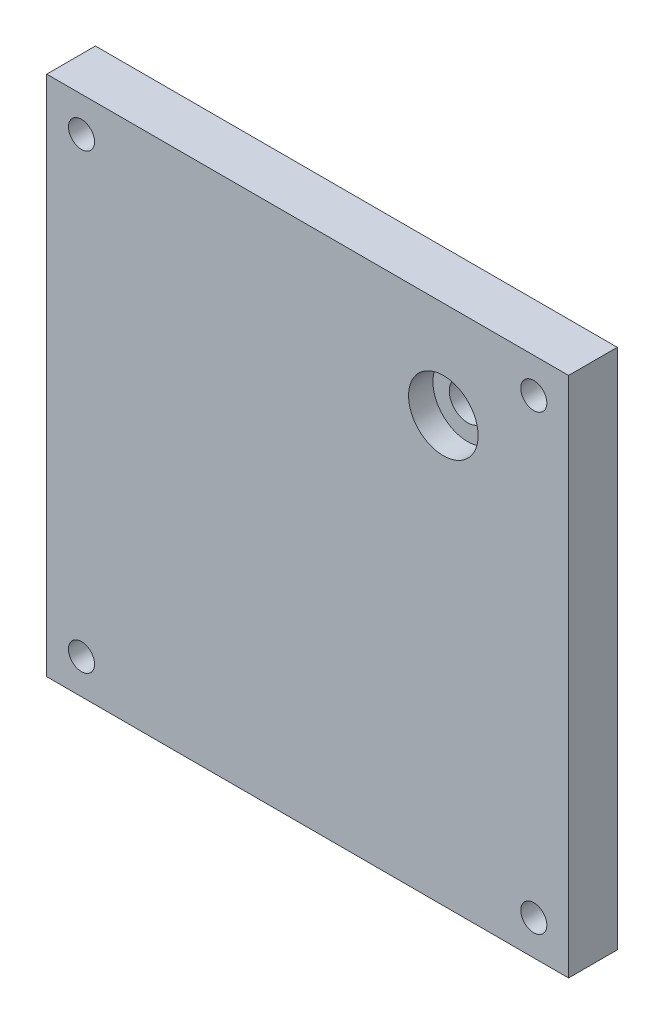
ISO-10303-21;
HEADER;
FILE_DESCRIPTION(('STEP AP214'),'2;1');
FILE_NAME('part.step','',(''),(''),'','','');
FILE_SCHEMA(('AUTOMOTIVE_DESIGN { 1 0 10303 214 1 1 1 1 }'));
ENDSEC;
DATA;
#1=APPLICATION_CONTEXT('core data for automotive mechanical design processes');
#2=APPLICATION_PROTOCOL_DEFINITION('international standard','automotive_design',2000,#1);
#3=PRODUCT_CONTEXT('',#1,'mechanical');
#4=PRODUCT('Part','Part','',(#3));
#5=PRODUCT_RELATED_PRODUCT_CATEGORY('part','',(#4));
#6=PRODUCT_DEFINITION_FORMATION('','',#4);
#7=PRODUCT_DEFINITION_CONTEXT('part definition',#1,'design');
#8=PRODUCT_DEFINITION('design','',#6,#7);
#9=PRODUCT_DEFINITION_SHAPE('','',#8);
#10=(LENGTH_UNIT() NAMED_UNIT(*) SI_UNIT(.MILLI.,.METRE.));
#11=(NAMED_UNIT(*) PLANE_ANGLE_UNIT() SI_UNIT($,.RADIAN.));
#12=(NAMED_UNIT(*) SI_UNIT($,.STERADIAN.) SOLID_ANGLE_UNIT());
#13=UNCERTAINTY_MEASURE_WITH_UNIT(LENGTH_MEASURE(1.E-05),#10,'distance_accuracy_value','');
#14=(GEOMETRIC_REPRESENTATION_CONTEXT(3) GLOBAL_UNCERTAINTY_ASSIGNED_CONTEXT((#13)) GLOBAL_UNIT_ASSIGNED_CONTEXT((#10,
#11,#12)) REPRESENTATION_CONTEXT('',''));
#15=CARTESIAN_POINT('',(0.,0.,0.));
#16=DIRECTION('',(0.,0.,1.));
#17=DIRECTION('',(1.,0.,0.));
#18=AXIS2_PLACEMENT_3D('',#15,#16,#17);
#19=CARTESIAN_POINT('',(47.625,-47.625,8.89));
#20=DIRECTION('',(-1.,0.,0.));
#21=DIRECTION('',(0.,0.,1.));
#22=AXIS2_PLACEMENT_3D('',#19,#20,#21);
#23=PLANE('',#22);
#24=DIRECTION('',(0.,1.,0.));
#25=VECTOR('',#24,1.);
#26=CARTESIAN_POINT('',(47.625,-47.625,0.));
#27=LINE('',#26,#25);
#28=CARTESIAN_POINT('',(47.625,-47.625,0.));
#29=VERTEX_POINT('',#28);
#30=CARTESIAN_POINT('',(47.625,47.625,0.));
#31=VERTEX_POINT('',#30);
#32=EDGE_CURVE('E97',#29,#31,#27,.T.);
#33=ORIENTED_EDGE('',*,*,#32,.T.);
#34=DIRECTION('',(0.,0.,-1.));
#35=VECTOR('',#34,1.);
#36=CARTESIAN_POINT('',(47.625,47.625,8.89));
#37=LINE('',#36,#35);
#38=CARTESIAN_POINT('',(47.625,47.625,8.89));
#39=VERTEX_POINT('',#38);
#40=EDGE_CURVE('E12',#39,#31,#37,.T.);
#41=ORIENTED_EDGE('',*,*,#40,.F.);
#42=DIRECTION('',(0.,1.,0.));
#43=VECTOR('',#42,1.);
#44=CARTESIAN_POINT('',(47.625,-47.625,8.89));
#45=LINE('',#44,#43);
#46=CARTESIAN_POINT('',(47.625,-47.625,8.89));
#47=VERTEX_POINT('',#46);
#48=EDGE_CURVE('E85',#47,#39,#45,.T.);
#49=ORIENTED_EDGE('',*,*,#48,.F.);
#50=DIRECTION('',(0.,0.,-1.));
#51=VECTOR('',#50,1.);
#52=CARTESIAN_POINT('',(47.625,-47.625,8.89));
#53=LINE('',#52,#51);
#54=EDGE_CURVE('E93',#47,#29,#53,.T.);
#55=ORIENTED_EDGE('',*,*,#54,.T.);
#56=EDGE_LOOP('',(#33,#41,#49,#55));
#57=FACE_BOUND('',#56,.T.);
#58=ADVANCED_FACE('F34',(#57),#23,.F.);
#59=CARTESIAN_POINT('',(-47.625,47.625,8.89));
#60=DIRECTION('',(0.,-1.,0.));
#61=DIRECTION('',(0.,0.,-1.));
#62=AXIS2_PLACEMENT_3D('',#59,#60,#61);
#63=PLANE('',#62);
#64=DIRECTION('',(-1.,0.,0.));
#65=VECTOR('',#64,1.);
#66=CARTESIAN_POINT('',(-47.625,47.625,0.));
#67=LINE('',#66,#65);
#68=CARTESIAN_POINT('',(-47.625,47.625,0.));
#69=VERTEX_POINT('',#68);
#70=EDGE_CURVE('E89',#31,#69,#67,.T.);
#71=ORIENTED_EDGE('',*,*,#70,.T.);
#72=DIRECTION('',(0.,0.,-1.));
#73=VECTOR('',#72,1.);
#74=CARTESIAN_POINT('',(-47.625,47.625,8.89));
#75=LINE('',#74,#73);
#76=CARTESIAN_POINT('',(-47.625,47.625,8.89));
#77=VERTEX_POINT('',#76);
#78=EDGE_CURVE('E42',#77,#69,#75,.T.);
#79=ORIENTED_EDGE('',*,*,#78,.F.);
#80=DIRECTION('',(-1.,0.,0.));
#81=VECTOR('',#80,1.);
#82=CARTESIAN_POINT('',(-47.625,47.625,8.89));
#83=LINE('',#82,#81);
#84=EDGE_CURVE('E80',#39,#77,#83,.T.);
#85=ORIENTED_EDGE('',*,*,#84,.F.);
#86=ORIENTED_EDGE('',*,*,#40,.T.);
#87=EDGE_LOOP('',(#71,#79,#85,#86));
#88=FACE_BOUND('',#87,.T.);
#89=ADVANCED_FACE('F88',(#88),#63,.F.);
#90=CARTESIAN_POINT('',(-47.625,-47.625,8.89));
#91=DIRECTION('',(1.,0.,0.));
#92=DIRECTION('',(0.,0.,-1.));
#93=AXIS2_PLACEMENT_3D('',#90,#91,#92);
#94=PLANE('',#93);
#95=DIRECTION('',(0.,-1.,0.));
#96=VECTOR('',#95,1.);
#97=CARTESIAN_POINT('',(-47.625,-47.625,0.));
#98=LINE('',#97,#96);
#99=CARTESIAN_POINT('',(-47.625,-47.625,0.));
#100=VERTEX_POINT('',#99);
#101=EDGE_CURVE('E67',#69,#100,#98,.T.);
#102=ORIENTED_EDGE('',*,*,#101,.T.);
#103=DIRECTION('',(0.,0.,-1.));
#104=VECTOR('',#103,1.);
#105=CARTESIAN_POINT('',(-47.625,-47.625,8.89));
#106=LINE('',#105,#104);
#107=CARTESIAN_POINT('',(-47.625,-47.625,8.89));
#108=VERTEX_POINT('',#107);
#109=EDGE_CURVE('E90',#108,#100,#106,.T.);
#110=ORIENTED_EDGE('',*,*,#109,.F.);
#111=DIRECTION('',(0.,-1.,0.));
#112=VECTOR('',#111,1.);
#113=CARTESIAN_POINT('',(-47.625,-47.625,8.89));
#114=LINE('',#113,#112);
#115=EDGE_CURVE('E83',#77,#108,#114,.T.);
#116=ORIENTED_EDGE('',*,*,#115,.F.);
#117=ORIENTED_EDGE('',*,*,#78,.T.);
#118=EDGE_LOOP('',(#102,#110,#116,#117));
#119=FACE_BOUND('',#118,.T.);
#120=ADVANCED_FACE('F91',(#119),#94,.F.);
#121=CARTESIAN_POINT('',(-47.625,-47.625,8.89));
#122=DIRECTION('',(0.,1.,0.));
#123=DIRECTION('',(0.,0.,1.));
#124=AXIS2_PLACEMENT_3D('',#121,#122,#123);
#125=PLANE('',#124);
#126=DIRECTION('',(1.,0.,0.));
#127=VECTOR('',#126,1.);
#128=CARTESIAN_POINT('',(-47.625,-47.625,0.));
#129=LINE('',#128,#127);
#130=EDGE_CURVE('E73',#100,#29,#129,.T.);
#131=ORIENTED_EDGE('',*,*,#130,.T.);
#132=ORIENTED_EDGE('',*,*,#54,.F.);
#133=DIRECTION('',(1.,0.,0.));
#134=VECTOR('',#133,1.);
#135=CARTESIAN_POINT('',(-47.625,-47.625,8.89));
#136=LINE('',#135,#134);
#137=EDGE_CURVE('E50',#108,#47,#136,.T.);
#138=ORIENTED_EDGE('',*,*,#137,.F.);
#139=ORIENTED_EDGE('',*,*,#109,.T.);
#140=EDGE_LOOP('',(#131,#132,#138,#139));
#141=FACE_BOUND('',#140,.T.);
#142=ADVANCED_FACE('F105',(#141),#125,.F.);
#143=CARTESIAN_POINT('',(0.,0.,8.89));
#144=DIRECTION('',(0.,0.,-1.));
#145=DIRECTION('',(-1.,0.,0.));
#146=AXIS2_PLACEMENT_3D('',#143,#144,#145);
#147=PLANE('',#146);
#148=CARTESIAN_POINT('',(24.765,29.845,8.89));
#149=DIRECTION('',(0.,0.,1.));
#150=DIRECTION('',(1.,0.,0.));
#151=AXIS2_PLACEMENT_3D('',#148,#149,#150);
#152=CIRCLE('',#151,6.35);
#153=CARTESIAN_POINT('',(31.115,29.845,8.89));
#154=VERTEX_POINT('',#153);
#155=EDGE_CURVE('E135',#154,#154,#152,.T.);
#156=ORIENTED_EDGE('',*,*,#155,.F.);
#157=EDGE_LOOP('',(#156));
#158=FACE_BOUND('',#157,.T.);
#159=CARTESIAN_POINT('',(41.275,-41.275,8.89));
#160=DIRECTION('',(0.,0.,1.));
#161=DIRECTION('',(1.,0.,0.));
#162=AXIS2_PLACEMENT_3D('',#159,#160,#161);
#163=CIRCLE('',#162,2.38125);
#164=CARTESIAN_POINT('',(43.65625,-41.275,8.89));
#165=VERTEX_POINT('',#164);
#166=EDGE_CURVE('E124',#165,#165,#163,.T.);
#167=ORIENTED_EDGE('',*,*,#166,.F.);
#168=EDGE_LOOP('',(#167));
#169=FACE_BOUND('',#168,.T.);
#170=CARTESIAN_POINT('',(-41.275,-41.275,8.89));
#171=DIRECTION('',(0.,0.,1.));
#172=DIRECTION('',(1.,0.,0.));
#173=AXIS2_PLACEMENT_3D('',#170,#171,#172);
#174=CIRCLE('',#173,2.38125);
#175=CARTESIAN_POINT('',(-38.89375,-41.275,8.89));
#176=VERTEX_POINT('',#175);
#177=EDGE_CURVE('E117',#176,#176,#174,.T.);
#178=ORIENTED_EDGE('',*,*,#177,.F.);
#179=EDGE_LOOP('',(#178));
#180=FACE_BOUND('',#179,.T.);
#181=CARTESIAN_POINT('',(-41.275,41.275,8.89));
#182=DIRECTION('',(0.,0.,1.));
#183=DIRECTION('',(1.,0.,0.));
#184=AXIS2_PLACEMENT_3D('',#181,#182,#183);
#185=CIRCLE('',#184,2.38125);
#186=CARTESIAN_POINT('',(-38.89375,41.275,8.89));
#187=VERTEX_POINT('',#186);
#188=EDGE_CURVE('E129',#187,#187,#185,.T.);
#189=ORIENTED_EDGE('',*,*,#188,.F.);
#190=EDGE_LOOP('',(#189));
#191=FACE_BOUND('',#190,.T.);
#192=CARTESIAN_POINT('',(41.275,41.275,8.89));
#193=DIRECTION('',(0.,0.,1.));
#194=DIRECTION('',(1.,0.,0.));
#195=AXIS2_PLACEMENT_3D('',#192,#193,#194);
#196=CIRCLE('',#195,2.38125);
#197=CARTESIAN_POINT('',(43.65625,41.275,8.89));
#198=VERTEX_POINT('',#197);
#199=EDGE_CURVE('E111',#198,#198,#196,.T.);
#200=ORIENTED_EDGE('',*,*,#199,.F.);
#201=EDGE_LOOP('',(#200));
#202=FACE_BOUND('',#201,.T.);
#203=ORIENTED_EDGE('',*,*,#48,.T.);
#204=ORIENTED_EDGE('',*,*,#84,.T.);
#205=ORIENTED_EDGE('',*,*,#115,.T.);
#206=ORIENTED_EDGE('',*,*,#137,.T.);
#207=EDGE_LOOP('',(#203,#204,#205,#206));
#208=FACE_BOUND('',#207,.T.);
#209=ADVANCED_FACE('F81',(#158,#169,#180,#191,#202,#208),#147,.F.);
#210=CARTESIAN_POINT('',(0.,0.,0.));
#211=DIRECTION('',(0.,0.,-1.));
#212=DIRECTION('',(-1.,0.,0.));
#213=AXIS2_PLACEMENT_3D('',#210,#211,#212);
#214=PLANE('',#213);
#215=CARTESIAN_POINT('',(24.765,29.845,0.));
#216=DIRECTION('',(0.,0.,1.));
#217=DIRECTION('',(1.,0.,0.));
#218=AXIS2_PLACEMENT_3D('',#215,#216,#217);
#219=CIRCLE('',#218,3.3655);
#220=CARTESIAN_POINT('',(28.1305,29.845,0.));
#221=VERTEX_POINT('',#220);
#222=EDGE_CURVE('E138',#221,#221,#219,.T.);
#223=ORIENTED_EDGE('',*,*,#222,.T.);
#224=EDGE_LOOP('',(#223));
#225=FACE_BOUND('',#224,.T.);
#226=CARTESIAN_POINT('',(41.275,-41.275,0.));
#227=DIRECTION('',(0.,0.,1.));
#228=DIRECTION('',(1.,0.,0.));
#229=AXIS2_PLACEMENT_3D('',#226,#227,#228);
#230=CIRCLE('',#229,2.38125);
#231=CARTESIAN_POINT('',(43.65625,-41.275,0.));
#232=VERTEX_POINT('',#231);
#233=EDGE_CURVE('E114',#232,#232,#230,.T.);
#234=ORIENTED_EDGE('',*,*,#233,.T.);
#235=EDGE_LOOP('',(#234));
#236=FACE_BOUND('',#235,.T.);
#237=CARTESIAN_POINT('',(-41.275,-41.275,0.));
#238=DIRECTION('',(0.,0.,1.));
#239=DIRECTION('',(1.,0.,0.));
#240=AXIS2_PLACEMENT_3D('',#237,#238,#239);
#241=CIRCLE('',#240,2.38125);
#242=CARTESIAN_POINT('',(-38.89375,-41.275,0.));
#243=VERTEX_POINT('',#242);
#244=EDGE_CURVE('E120',#243,#243,#241,.T.);
#245=ORIENTED_EDGE('',*,*,#244,.T.);
#246=EDGE_LOOP('',(#245));
#247=FACE_BOUND('',#246,.T.);
#248=CARTESIAN_POINT('',(-41.275,41.275,0.));
#249=DIRECTION('',(0.,0.,1.));
#250=DIRECTION('',(1.,0.,0.));
#251=AXIS2_PLACEMENT_3D('',#248,#249,#250);
#252=CIRCLE('',#251,2.38125);
#253=CARTESIAN_POINT('',(-38.89375,41.275,0.));
#254=VERTEX_POINT('',#253);
#255=EDGE_CURVE('E121',#254,#254,#252,.T.);
#256=ORIENTED_EDGE('',*,*,#255,.T.);
#257=EDGE_LOOP('',(#256));
#258=FACE_BOUND('',#257,.T.);
#259=CARTESIAN_POINT('',(41.275,41.275,0.));
#260=DIRECTION('',(0.,0.,1.));
#261=DIRECTION('',(1.,0.,0.));
#262=AXIS2_PLACEMENT_3D('',#259,#260,#261);
#263=CIRCLE('',#262,2.38125);
#264=CARTESIAN_POINT('',(43.65625,41.275,0.));
#265=VERTEX_POINT('',#264);
#266=EDGE_CURVE('E100',#265,#265,#263,.T.);
#267=ORIENTED_EDGE('',*,*,#266,.T.);
#268=EDGE_LOOP('',(#267));
#269=FACE_BOUND('',#268,.T.);
#270=ORIENTED_EDGE('',*,*,#32,.F.);
#271=ORIENTED_EDGE('',*,*,#130,.F.);
#272=ORIENTED_EDGE('',*,*,#101,.F.);
#273=ORIENTED_EDGE('',*,*,#70,.F.);
#274=EDGE_LOOP('',(#270,#271,#272,#273));
#275=FACE_BOUND('',#274,.T.);
#276=ADVANCED_FACE('F108',(#225,#236,#247,#258,#269,#275),#214,.T.);
#277=CARTESIAN_POINT('',(41.275,41.275,0.));
#278=DIRECTION('',(0.,0.,1.));
#279=DIRECTION('',(1.,0.,0.));
#280=AXIS2_PLACEMENT_3D('',#277,#278,#279);
#281=CYLINDRICAL_SURFACE('',#280,2.38125);
#282=ORIENTED_EDGE('',*,*,#266,.F.);
#283=EDGE_LOOP('',(#282));
#284=FACE_BOUND('',#283,.T.);
#285=ORIENTED_EDGE('',*,*,#199,.T.);
#286=EDGE_LOOP('',(#285));
#287=FACE_BOUND('',#286,.T.);
#288=ADVANCED_FACE('F179',(#284,#287),#281,.F.);
#289=CARTESIAN_POINT('',(-41.275,41.275,0.));
#290=DIRECTION('',(0.,0.,1.));
#291=DIRECTION('',(1.,0.,0.));
#292=AXIS2_PLACEMENT_3D('',#289,#290,#291);
#293=CYLINDRICAL_SURFACE('',#292,2.38125);
#294=ORIENTED_EDGE('',*,*,#255,.F.);
#295=EDGE_LOOP('',(#294));
#296=FACE_BOUND('',#295,.T.);
#297=ORIENTED_EDGE('',*,*,#188,.T.);
#298=EDGE_LOOP('',(#297));
#299=FACE_BOUND('',#298,.T.);
#300=ADVANCED_FACE('F181',(#296,#299),#293,.F.);
#301=CARTESIAN_POINT('',(-41.275,-41.275,0.));
#302=DIRECTION('',(0.,0.,1.));
#303=DIRECTION('',(1.,0.,0.));
#304=AXIS2_PLACEMENT_3D('',#301,#302,#303);
#305=CYLINDRICAL_SURFACE('',#304,2.38125);
#306=ORIENTED_EDGE('',*,*,#244,.F.);
#307=EDGE_LOOP('',(#306));
#308=FACE_BOUND('',#307,.T.);
#309=ORIENTED_EDGE('',*,*,#177,.T.);
#310=EDGE_LOOP('',(#309));
#311=FACE_BOUND('',#310,.T.);
#312=ADVANCED_FACE('F188',(#308,#311),#305,.F.);
#313=CARTESIAN_POINT('',(41.275,-41.275,0.));
#314=DIRECTION('',(0.,0.,1.));
#315=DIRECTION('',(1.,0.,0.));
#316=AXIS2_PLACEMENT_3D('',#313,#314,#315);
#317=CYLINDRICAL_SURFACE('',#316,2.38125);
#318=ORIENTED_EDGE('',*,*,#233,.F.);
#319=EDGE_LOOP('',(#318));
#320=FACE_BOUND('',#319,.T.);
#321=ORIENTED_EDGE('',*,*,#166,.T.);
#322=EDGE_LOOP('',(#321));
#323=FACE_BOUND('',#322,.T.);
#324=ADVANCED_FACE('F164',(#320,#323),#317,.F.);
#325=CARTESIAN_POINT('',(24.765,29.845,4.445));
#326=DIRECTION('',(0.,0.,1.));
#327=DIRECTION('',(1.,0.,0.));
#328=AXIS2_PLACEMENT_3D('',#325,#326,#327);
#329=CYLINDRICAL_SURFACE('',#328,6.35);
#330=CARTESIAN_POINT('',(24.765,29.845,4.445));
#331=DIRECTION('',(0.,0.,1.));
#332=DIRECTION('',(1.,0.,0.));
#333=AXIS2_PLACEMENT_3D('',#330,#331,#332);
#334=CIRCLE('',#333,6.35);
#335=CARTESIAN_POINT('',(31.115,29.845,4.445));
#336=VERTEX_POINT('',#335);
#337=EDGE_CURVE('E132',#336,#336,#334,.T.);
#338=ORIENTED_EDGE('',*,*,#337,.F.);
#339=EDGE_LOOP('',(#338));
#340=FACE_BOUND('',#339,.T.);
#341=ORIENTED_EDGE('',*,*,#155,.T.);
#342=EDGE_LOOP('',(#341));
#343=FACE_BOUND('',#342,.T.);
#344=ADVANCED_FACE('F158',(#340,#343),#329,.F.);
#345=CARTESIAN_POINT('',(24.765,29.845,4.445));
#346=DIRECTION('',(0.,0.,1.));
#347=DIRECTION('',(1.,0.,0.));
#348=AXIS2_PLACEMENT_3D('',#345,#346,#347);
#349=PLANE('',#348);
#350=CARTESIAN_POINT('',(24.765,29.845,4.445));
#351=DIRECTION('',(0.,0.,1.));
#352=DIRECTION('',(1.,0.,0.));
#353=AXIS2_PLACEMENT_3D('',#350,#351,#352);
#354=CIRCLE('',#353,3.3655);
#355=CARTESIAN_POINT('',(28.1305,29.845,4.445));
#356=VERTEX_POINT('',#355);
#357=EDGE_CURVE('E141',#356,#356,#354,.T.);
#358=ORIENTED_EDGE('',*,*,#357,.F.);
#359=EDGE_LOOP('',(#358));
#360=FACE_BOUND('',#359,.T.);
#361=ORIENTED_EDGE('',*,*,#337,.T.);
#362=EDGE_LOOP('',(#361));
#363=FACE_BOUND('',#362,.T.);
#364=ADVANCED_FACE('F152',(#360,#363),#349,.T.);
#365=CARTESIAN_POINT('',(24.765,29.845,0.));
#366=DIRECTION('',(0.,0.,1.));
#367=DIRECTION('',(1.,0.,0.));
#368=AXIS2_PLACEMENT_3D('',#365,#366,#367);
#369=CYLINDRICAL_SURFACE('',#368,3.3655);
#370=ORIENTED_EDGE('',*,*,#222,.F.);
#371=EDGE_LOOP('',(#370));
#372=FACE_BOUND('',#371,.T.);
#373=ORIENTED_EDGE('',*,*,#357,.T.);
#374=EDGE_LOOP('',(#373));
#375=FACE_BOUND('',#374,.T.);
#376=ADVANCED_FACE('F149',(#372,#375),#369,.F.);
#377=CLOSED_SHELL('',(#58,#89,#120,#142,#209,#276,#288,#300,#312,#324,#344,#364,#376));
#378=MANIFOLD_SOLID_BREP('B2',#377);
#379=ADVANCED_BREP_SHAPE_REPRESENTATION('',(#18,#378),#14);
#380=SHAPE_DEFINITION_REPRESENTATION(#9,#379);
ENDSEC;
END-ISO-10303-21;
